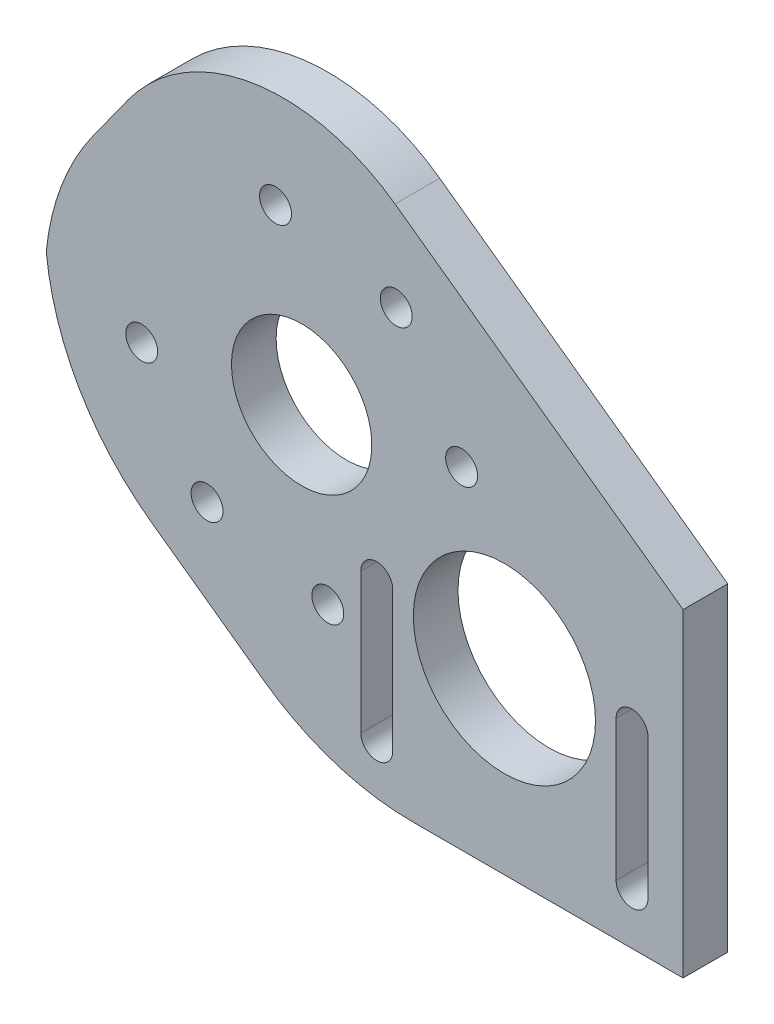
ISO-10303-21;
HEADER;
FILE_DESCRIPTION(('STEP AP214'),'2;1');
FILE_NAME('part.step','',(''),(''),'','','');
FILE_SCHEMA(('AUTOMOTIVE_DESIGN { 1 0 10303 214 1 1 1 1 }'));
ENDSEC;
DATA;
#1=APPLICATION_CONTEXT('core data for automotive mechanical design processes');
#2=APPLICATION_PROTOCOL_DEFINITION('international standard','automotive_design',2000,#1);
#3=PRODUCT_CONTEXT('',#1,'mechanical');
#4=PRODUCT('Part','Part','',(#3));
#5=PRODUCT_RELATED_PRODUCT_CATEGORY('part','',(#4));
#6=PRODUCT_DEFINITION_FORMATION('','',#4);
#7=PRODUCT_DEFINITION_CONTEXT('part definition',#1,'design');
#8=PRODUCT_DEFINITION('design','',#6,#7);
#9=PRODUCT_DEFINITION_SHAPE('','',#8);
#10=(LENGTH_UNIT() NAMED_UNIT(*) SI_UNIT(.MILLI.,.METRE.));
#11=(NAMED_UNIT(*) PLANE_ANGLE_UNIT() SI_UNIT($,.RADIAN.));
#12=(NAMED_UNIT(*) SI_UNIT($,.STERADIAN.) SOLID_ANGLE_UNIT());
#13=UNCERTAINTY_MEASURE_WITH_UNIT(LENGTH_MEASURE(1.E-05),#10,'distance_accuracy_value','');
#14=(GEOMETRIC_REPRESENTATION_CONTEXT(3) GLOBAL_UNCERTAINTY_ASSIGNED_CONTEXT((#13)) GLOBAL_UNIT_ASSIGNED_CONTEXT((#10,
#11,#12)) REPRESENTATION_CONTEXT('',''));
#15=CARTESIAN_POINT('',(0.,0.,0.));
#16=DIRECTION('',(0.,0.,1.));
#17=DIRECTION('',(1.,0.,0.));
#18=AXIS2_PLACEMENT_3D('',#15,#16,#17);
#19=CARTESIAN_POINT('',(0.,0.,7.));
#20=DIRECTION('',(0.,1.,0.));
#21=DIRECTION('',(0.,0.,1.));
#22=AXIS2_PLACEMENT_3D('',#19,#20,#21);
#23=PLANE('',#22);
#24=DIRECTION('',(1.,0.,0.));
#25=VECTOR('',#24,1.);
#26=CARTESIAN_POINT('',(0.,0.,7.));
#27=LINE('',#26,#25);
#28=CARTESIAN_POINT('',(57.6399419284707,0.,7.));
#29=VERTEX_POINT('',#28);
#30=CARTESIAN_POINT('',(100.,0.,7.));
#31=VERTEX_POINT('',#30);
#32=EDGE_CURVE('E190',#29,#31,#27,.T.);
#33=ORIENTED_EDGE('',*,*,#32,.F.);
#34=DIRECTION('',(0.,0.,1.));
#35=VECTOR('',#34,1.);
#36=CARTESIAN_POINT('',(57.6399419284707,0.,0.));
#37=LINE('',#36,#35);
#38=CARTESIAN_POINT('',(57.6399419284707,0.,0.));
#39=VERTEX_POINT('',#38);
#40=EDGE_CURVE('E227',#29,#39,#37,.F.);
#41=ORIENTED_EDGE('',*,*,#40,.T.);
#42=DIRECTION('',(1.,0.,0.));
#43=VECTOR('',#42,1.);
#44=CARTESIAN_POINT('',(0.,0.,0.));
#45=LINE('',#44,#43);
#46=CARTESIAN_POINT('',(100.,0.,0.));
#47=VERTEX_POINT('',#46);
#48=EDGE_CURVE('E186',#39,#47,#45,.T.);
#49=ORIENTED_EDGE('',*,*,#48,.T.);
#50=DIRECTION('',(0.,0.,-1.));
#51=VECTOR('',#50,1.);
#52=CARTESIAN_POINT('',(100.,0.,7.));
#53=LINE('',#52,#51);
#54=EDGE_CURVE('E191',#31,#47,#53,.T.);
#55=ORIENTED_EDGE('',*,*,#54,.F.);
#56=EDGE_LOOP('',(#33,#41,#49,#55));
#57=FACE_BOUND('',#56,.T.);
#58=ADVANCED_FACE('F44',(#57),#23,.F.);
#59=CARTESIAN_POINT('',(0.,0.,7.));
#60=DIRECTION('',(0.,0.,-1.));
#61=DIRECTION('',(-1.,0.,0.));
#62=AXIS2_PLACEMENT_3D('',#59,#60,#61);
#63=PLANE('',#62);
#64=CARTESIAN_POINT('',(72.,28.,7.));
#65=DIRECTION('',(0.,0.,1.));
#66=DIRECTION('',(1.,0.,0.));
#67=AXIS2_PLACEMENT_3D('',#64,#65,#66);
#68=CIRCLE('',#67,14.275);
#69=CARTESIAN_POINT('',(86.275,28.,7.));
#70=VERTEX_POINT('',#69);
#71=EDGE_CURVE('E195',#70,#70,#68,.T.);
#72=ORIENTED_EDGE('',*,*,#71,.F.);
#73=EDGE_LOOP('',(#72));
#74=FACE_BOUND('',#73,.T.);
#75=DIRECTION('',(0.,-1.,0.));
#76=VECTOR('',#75,1.);
#77=CARTESIAN_POINT('',(49.5,30.,7.));
#78=LINE('',#77,#76);
#79=CARTESIAN_POINT('',(49.5,30.,7.));
#80=VERTEX_POINT('',#79);
#81=CARTESIAN_POINT('',(49.5,8.,7.));
#82=VERTEX_POINT('',#81);
#83=EDGE_CURVE('E324',#80,#82,#78,.T.);
#84=ORIENTED_EDGE('',*,*,#83,.F.);
#85=CARTESIAN_POINT('',(52.,30.,7.));
#86=DIRECTION('',(0.,0.,1.));
#87=DIRECTION('',(1.,0.,0.));
#88=AXIS2_PLACEMENT_3D('',#85,#86,#87);
#89=CIRCLE('',#88,2.5);
#90=CARTESIAN_POINT('',(54.5,30.,7.));
#91=VERTEX_POINT('',#90);
#92=EDGE_CURVE('E328',#91,#80,#89,.T.);
#93=ORIENTED_EDGE('',*,*,#92,.F.);
#94=DIRECTION('',(0.,1.,0.));
#95=VECTOR('',#94,1.);
#96=CARTESIAN_POINT('',(54.5,30.,7.));
#97=LINE('',#96,#95);
#98=CARTESIAN_POINT('',(54.5,8.,7.));
#99=VERTEX_POINT('',#98);
#100=EDGE_CURVE('E317',#99,#91,#97,.T.);
#101=ORIENTED_EDGE('',*,*,#100,.F.);
#102=CARTESIAN_POINT('',(52.,8.,7.));
#103=DIRECTION('',(0.,0.,1.));
#104=DIRECTION('',(1.,0.,0.));
#105=AXIS2_PLACEMENT_3D('',#102,#103,#104);
#106=CIRCLE('',#105,2.5);
#107=EDGE_CURVE('E316',#82,#99,#106,.T.);
#108=ORIENTED_EDGE('',*,*,#107,.F.);
#109=EDGE_LOOP('',(#84,#93,#101,#108));
#110=FACE_BOUND('',#109,.T.);
#111=DIRECTION('',(0.,-1.,0.));
#112=VECTOR('',#111,1.);
#113=CARTESIAN_POINT('',(89.5,30.,7.));
#114=LINE('',#113,#112);
#115=CARTESIAN_POINT('',(89.5,30.,7.));
#116=VERTEX_POINT('',#115);
#117=CARTESIAN_POINT('',(89.5,8.,7.));
#118=VERTEX_POINT('',#117);
#119=EDGE_CURVE('E351',#116,#118,#114,.T.);
#120=ORIENTED_EDGE('',*,*,#119,.F.);
#121=CARTESIAN_POINT('',(92.,30.,7.));
#122=DIRECTION('',(0.,0.,1.));
#123=DIRECTION('',(1.,0.,0.));
#124=AXIS2_PLACEMENT_3D('',#121,#122,#123);
#125=CIRCLE('',#124,2.50000000000002);
#126=CARTESIAN_POINT('',(94.5,30.,7.));
#127=VERTEX_POINT('',#126);
#128=EDGE_CURVE('E314',#127,#116,#125,.T.);
#129=ORIENTED_EDGE('',*,*,#128,.F.);
#130=DIRECTION('',(0.,1.,0.));
#131=VECTOR('',#130,1.);
#132=CARTESIAN_POINT('',(94.5,30.,7.));
#133=LINE('',#132,#131);
#134=CARTESIAN_POINT('',(94.5,8.,7.));
#135=VERTEX_POINT('',#134);
#136=EDGE_CURVE('E350',#135,#127,#133,.T.);
#137=ORIENTED_EDGE('',*,*,#136,.F.);
#138=CARTESIAN_POINT('',(92.,8.,7.));
#139=DIRECTION('',(0.,0.,1.));
#140=DIRECTION('',(1.,0.,0.));
#141=AXIS2_PLACEMENT_3D('',#138,#139,#140);
#142=CIRCLE('',#141,2.5);
#143=EDGE_CURVE('E349',#118,#135,#142,.T.);
#144=ORIENTED_EDGE('',*,*,#143,.F.);
#145=EDGE_LOOP('',(#120,#129,#137,#144));
#146=FACE_BOUND('',#145,.T.);
#147=CARTESIAN_POINT('',(40.2255244130042,47.9156396124104,7.));
#148=DIRECTION('',(0.,0.,-1.));
#149=DIRECTION('',(-1.,0.,0.));
#150=AXIS2_PLACEMENT_3D('',#147,#148,#149);
#151=CIRCLE('',#150,11.);
#152=CARTESIAN_POINT('',(29.2255244130042,47.9156396124104,7.));
#153=VERTEX_POINT('',#152);
#154=EDGE_CURVE('E301',#153,#153,#151,.T.);
#155=ORIENTED_EDGE('',*,*,#154,.T.);
#156=EDGE_LOOP('',(#155));
#157=FACE_BOUND('',#156,.T.);
#158=CARTESIAN_POINT('',(65.2929630047839,52.0124093700795,7.));
#159=DIRECTION('',(0.,0.,-1.));
#160=DIRECTION('',(-1.,0.,0.));
#161=AXIS2_PLACEMENT_3D('',#158,#159,#160);
#162=CIRCLE('',#161,2.5);
#163=CARTESIAN_POINT('',(62.7929630047839,52.0124093700795,7.));
#164=VERTEX_POINT('',#163);
#165=EDGE_CURVE('E260',#164,#164,#162,.T.);
#166=ORIENTED_EDGE('',*,*,#165,.T.);
#167=EDGE_LOOP('',(#166));
#168=FACE_BOUND('',#167,.T.);
#169=CARTESIAN_POINT('',(55.0540265516212,68.537849104243,7.));
#170=DIRECTION('',(0.,0.,-1.));
#171=DIRECTION('',(-1.,0.,0.));
#172=AXIS2_PLACEMENT_3D('',#169,#170,#171);
#173=CIRCLE('',#172,2.5);
#174=CARTESIAN_POINT('',(52.5540265516212,68.537849104243,7.));
#175=VERTEX_POINT('',#174);
#176=EDGE_CURVE('E295',#175,#175,#173,.T.);
#177=ORIENTED_EDGE('',*,*,#176,.T.);
#178=EDGE_LOOP('',(#177));
#179=FACE_BOUND('',#178,.T.);
#180=CARTESIAN_POINT('',(44.3222941706733,22.8482010206306,7.));
#181=DIRECTION('',(0.,0.,-1.));
#182=DIRECTION('',(-1.,0.,0.));
#183=AXIS2_PLACEMENT_3D('',#180,#181,#182);
#184=CIRCLE('',#183,2.5);
#185=CARTESIAN_POINT('',(41.8222941706733,22.8482010206306,7.));
#186=VERTEX_POINT('',#185);
#187=EDGE_CURVE('E290',#186,#186,#184,.T.);
#188=ORIENTED_EDGE('',*,*,#187,.T.);
#189=EDGE_LOOP('',(#188));
#190=FACE_BOUND('',#189,.T.);
#191=CARTESIAN_POINT('',(25.3970222743872,27.2934301205777,7.));
#192=DIRECTION('',(0.,0.,-1.));
#193=DIRECTION('',(-1.,0.,0.));
#194=AXIS2_PLACEMENT_3D('',#191,#192,#193);
#195=CIRCLE('',#194,2.5);
#196=CARTESIAN_POINT('',(22.8970222743872,27.2934301205777,7.));
#197=VERTEX_POINT('',#196);
#198=EDGE_CURVE('E285',#197,#197,#195,.T.);
#199=ORIENTED_EDGE('',*,*,#198,.T.);
#200=EDGE_LOOP('',(#199));
#201=FACE_BOUND('',#200,.T.);
#202=CARTESIAN_POINT('',(36.128754655335,72.9830782041901,7.));
#203=DIRECTION('',(0.,0.,-1.));
#204=DIRECTION('',(-1.,0.,0.));
#205=AXIS2_PLACEMENT_3D('',#202,#203,#204);
#206=CIRCLE('',#205,2.5);
#207=CARTESIAN_POINT('',(33.628754655335,72.9830782041901,7.));
#208=VERTEX_POINT('',#207);
#209=EDGE_CURVE('E276',#208,#208,#206,.T.);
#210=ORIENTED_EDGE('',*,*,#209,.T.);
#211=EDGE_LOOP('',(#210));
#212=FACE_BOUND('',#211,.T.);
#213=CARTESIAN_POINT('',(15.1580858212245,43.8188698547412,7.));
#214=DIRECTION('',(0.,0.,-1.));
#215=DIRECTION('',(-1.,0.,0.));
#216=AXIS2_PLACEMENT_3D('',#213,#214,#215);
#217=CIRCLE('',#216,2.5);
#218=CARTESIAN_POINT('',(12.6580858212245,43.8188698547412,7.));
#219=VERTEX_POINT('',#218);
#220=EDGE_CURVE('E267',#219,#219,#217,.T.);
#221=ORIENTED_EDGE('',*,*,#220,.T.);
#222=EDGE_LOOP('',(#221));
#223=FACE_BOUND('',#222,.T.);
#224=DIRECTION('',(-0.811720156453846,0.584046562875379,0.));
#225=VECTOR('',#224,1.);
#226=CARTESIAN_POINT('',(15.2630151135655,21.2128583634596,7.));
#227=LINE('',#226,#225);
#228=CARTESIAN_POINT('',(34.2780794134555,7.53119374184617,7.));
#229=VERTEX_POINT('',#228);
#230=CARTESIAN_POINT('',(16.6381374849848,20.223434251991,7.));
#231=VERTEX_POINT('',#230);
#232=EDGE_CURVE('E243',#229,#231,#227,.T.);
#233=ORIENTED_EDGE('',*,*,#232,.F.);
#234=CARTESIAN_POINT('',(57.6399419284707,40.,7.00000000000001));
#235=DIRECTION('',(0.,0.,-1.));
#236=DIRECTION('',(-1.,0.,0.));
#237=AXIS2_PLACEMENT_3D('',#234,#235,#236);
#238=CIRCLE('',#237,40.);
#239=EDGE_CURVE('E223',#229,#29,#238,.F.);
#240=ORIENTED_EDGE('',*,*,#239,.T.);
#241=ORIENTED_EDGE('',*,*,#32,.T.);
#242=DIRECTION('',(0.,1.,0.));
#243=VECTOR('',#242,1.);
#244=CARTESIAN_POINT('',(100.,0.,7.));
#245=LINE('',#244,#243);
#246=CARTESIAN_POINT('',(100.,50.,7.00000000000001));
#247=VERTEX_POINT('',#246);
#248=EDGE_CURVE('E179',#31,#247,#245,.T.);
#249=ORIENTED_EDGE('',*,*,#248,.T.);
#250=DIRECTION('',(0.811720156453846,-0.584046562875379,0.));
#251=VECTOR('',#250,1.);
#252=CARTESIAN_POINT('',(57.8151571303311,80.3527173590261,7.));
#253=LINE('',#252,#251);
#254=CARTESIAN_POINT('',(54.860556543483,82.4786031137386,7.));
#255=VERTEX_POINT('',#254);
#256=EDGE_CURVE('E161',#255,#247,#253,.T.);
#257=ORIENTED_EDGE('',*,*,#256,.F.);
#258=CARTESIAN_POINT('',(37.3391596572216,58.1269984201233,7.00000000000001));
#259=DIRECTION('',(0.,0.,-1.));
#260=DIRECTION('',(-1.,0.,0.));
#261=AXIS2_PLACEMENT_3D('',#258,#259,#260);
#262=CIRCLE('',#261,30.);
#263=CARTESIAN_POINT('',(12.9875549636062,75.6483953063846,7.));
#264=VERTEX_POINT('',#263);
#265=EDGE_CURVE('E206',#255,#264,#262,.F.);
#266=ORIENTED_EDGE('',*,*,#265,.T.);
#267=DIRECTION('',(0.584046562875379,0.811720156453846,0.));
#268=VECTOR('',#267,1.);
#269=CARTESIAN_POINT('',(-27.3062052804635,19.6472826409738,7.));
#270=LINE('',#269,#268);
#271=CARTESIAN_POINT('',(7.53119374184616,68.0650300986677,7.));
#272=VERTEX_POINT('',#271);
#273=EDGE_CURVE('E172',#272,#264,#270,.T.);
#274=ORIENTED_EDGE('',*,*,#273,.F.);
#275=CARTESIAN_POINT('',(40.,44.7031675836526,7.00000000000001));
#276=DIRECTION('',(0.,0.,-1.));
#277=DIRECTION('',(-1.,0.,0.));
#278=AXIS2_PLACEMENT_3D('',#275,#276,#277);
#279=CIRCLE('',#278,40.);
#280=CARTESIAN_POINT('',(0.199953788421331,48.6977040468987,7.));
#281=VERTEX_POINT('',#280);
#282=EDGE_CURVE('E222',#272,#281,#279,.F.);
#283=ORIENTED_EDGE('',*,*,#282,.T.);
#284=CARTESIAN_POINT('',(40.,52.6922405101448,7.));
#285=DIRECTION('',(0.,0.,-1.));
#286=DIRECTION('',(-1.,0.,0.));
#287=AXIS2_PLACEMENT_3D('',#284,#285,#286);
#288=CIRCLE('',#287,40.);
#289=EDGE_CURVE('E225',#281,#231,#288,.F.);
#290=ORIENTED_EDGE('',*,*,#289,.T.);
#291=EDGE_LOOP('',(#233,#240,#241,#249,#257,#266,#274,#283,#290));
#292=FACE_BOUND('',#291,.T.);
#293=ADVANCED_FACE('F184',(#74,#110,#146,#157,#168,#179,#190,#201,#212,#223,#292),#63,.F.);
#294=CARTESIAN_POINT('',(0.,0.,0.));
#295=DIRECTION('',(0.,0.,-1.));
#296=DIRECTION('',(-1.,0.,0.));
#297=AXIS2_PLACEMENT_3D('',#294,#295,#296);
#298=PLANE('',#297);
#299=CARTESIAN_POINT('',(15.1580858212245,43.8188698547412,0.));
#300=DIRECTION('',(0.,0.,-1.));
#301=DIRECTION('',(-1.,0.,0.));
#302=AXIS2_PLACEMENT_3D('',#299,#300,#301);
#303=CIRCLE('',#302,2.5);
#304=CARTESIAN_POINT('',(12.6580858212245,43.8188698547412,0.));
#305=VERTEX_POINT('',#304);
#306=EDGE_CURVE('E268',#305,#305,#303,.T.);
#307=ORIENTED_EDGE('',*,*,#306,.F.);
#308=EDGE_LOOP('',(#307));
#309=FACE_BOUND('',#308,.T.);
#310=CARTESIAN_POINT('',(36.128754655335,72.9830782041901,0.));
#311=DIRECTION('',(0.,0.,-1.));
#312=DIRECTION('',(-1.,0.,0.));
#313=AXIS2_PLACEMENT_3D('',#310,#311,#312);
#314=CIRCLE('',#313,2.5);
#315=CARTESIAN_POINT('',(33.628754655335,72.9830782041901,0.));
#316=VERTEX_POINT('',#315);
#317=EDGE_CURVE('E271',#316,#316,#314,.T.);
#318=ORIENTED_EDGE('',*,*,#317,.F.);
#319=EDGE_LOOP('',(#318));
#320=FACE_BOUND('',#319,.T.);
#321=CARTESIAN_POINT('',(25.3970222743872,27.2934301205777,0.));
#322=DIRECTION('',(0.,0.,-1.));
#323=DIRECTION('',(-1.,0.,0.));
#324=AXIS2_PLACEMENT_3D('',#321,#322,#323);
#325=CIRCLE('',#324,2.5);
#326=CARTESIAN_POINT('',(22.8970222743872,27.2934301205777,0.));
#327=VERTEX_POINT('',#326);
#328=EDGE_CURVE('E278',#327,#327,#325,.T.);
#329=ORIENTED_EDGE('',*,*,#328,.F.);
#330=EDGE_LOOP('',(#329));
#331=FACE_BOUND('',#330,.T.);
#332=CARTESIAN_POINT('',(44.3222941706733,22.8482010206306,0.));
#333=DIRECTION('',(0.,0.,-1.));
#334=DIRECTION('',(-1.,0.,0.));
#335=AXIS2_PLACEMENT_3D('',#332,#333,#334);
#336=CIRCLE('',#335,2.5);
#337=CARTESIAN_POINT('',(41.8222941706733,22.8482010206306,0.));
#338=VERTEX_POINT('',#337);
#339=EDGE_CURVE('E284',#338,#338,#336,.T.);
#340=ORIENTED_EDGE('',*,*,#339,.F.);
#341=EDGE_LOOP('',(#340));
#342=FACE_BOUND('',#341,.T.);
#343=CARTESIAN_POINT('',(55.0540265516212,68.537849104243,0.));
#344=DIRECTION('',(0.,0.,-1.));
#345=DIRECTION('',(-1.,0.,0.));
#346=AXIS2_PLACEMENT_3D('',#343,#344,#345);
#347=CIRCLE('',#346,2.5);
#348=CARTESIAN_POINT('',(52.5540265516212,68.537849104243,0.));
#349=VERTEX_POINT('',#348);
#350=EDGE_CURVE('E293',#349,#349,#347,.T.);
#351=ORIENTED_EDGE('',*,*,#350,.F.);
#352=EDGE_LOOP('',(#351));
#353=FACE_BOUND('',#352,.T.);
#354=CARTESIAN_POINT('',(65.2929630047839,52.0124093700795,0.));
#355=DIRECTION('',(0.,0.,-1.));
#356=DIRECTION('',(-1.,0.,0.));
#357=AXIS2_PLACEMENT_3D('',#354,#355,#356);
#358=CIRCLE('',#357,2.5);
#359=CARTESIAN_POINT('',(62.7929630047839,52.0124093700795,0.));
#360=VERTEX_POINT('',#359);
#361=EDGE_CURVE('E261',#360,#360,#358,.T.);
#362=ORIENTED_EDGE('',*,*,#361,.F.);
#363=EDGE_LOOP('',(#362));
#364=FACE_BOUND('',#363,.T.);
#365=CARTESIAN_POINT('',(40.2255244130042,47.9156396124104,0.));
#366=DIRECTION('',(0.,0.,-1.));
#367=DIRECTION('',(-1.,0.,0.));
#368=AXIS2_PLACEMENT_3D('',#365,#366,#367);
#369=CIRCLE('',#368,11.);
#370=CARTESIAN_POINT('',(29.2255244130042,47.9156396124104,0.));
#371=VERTEX_POINT('',#370);
#372=EDGE_CURVE('E266',#371,#371,#369,.T.);
#373=ORIENTED_EDGE('',*,*,#372,.F.);
#374=EDGE_LOOP('',(#373));
#375=FACE_BOUND('',#374,.T.);
#376=CARTESIAN_POINT('',(92.,30.,0.));
#377=DIRECTION('',(0.,0.,1.));
#378=DIRECTION('',(1.,0.,0.));
#379=AXIS2_PLACEMENT_3D('',#376,#377,#378);
#380=CIRCLE('',#379,2.50000000000002);
#381=CARTESIAN_POINT('',(94.5,30.,0.));
#382=VERTEX_POINT('',#381);
#383=CARTESIAN_POINT('',(89.5,30.,0.));
#384=VERTEX_POINT('',#383);
#385=EDGE_CURVE('E352',#382,#384,#380,.T.);
#386=ORIENTED_EDGE('',*,*,#385,.T.);
#387=DIRECTION('',(0.,-1.,0.));
#388=VECTOR('',#387,1.);
#389=CARTESIAN_POINT('',(89.5,30.,0.));
#390=LINE('',#389,#388);
#391=CARTESIAN_POINT('',(89.5,8.,0.));
#392=VERTEX_POINT('',#391);
#393=EDGE_CURVE('E361',#384,#392,#390,.T.);
#394=ORIENTED_EDGE('',*,*,#393,.T.);
#395=CARTESIAN_POINT('',(92.,8.,0.));
#396=DIRECTION('',(0.,0.,1.));
#397=DIRECTION('',(1.,0.,0.));
#398=AXIS2_PLACEMENT_3D('',#395,#396,#397);
#399=CIRCLE('',#398,2.5);
#400=CARTESIAN_POINT('',(94.5,8.,0.));
#401=VERTEX_POINT('',#400);
#402=EDGE_CURVE('E359',#392,#401,#399,.T.);
#403=ORIENTED_EDGE('',*,*,#402,.T.);
#404=DIRECTION('',(0.,1.,0.));
#405=VECTOR('',#404,1.);
#406=CARTESIAN_POINT('',(94.5,30.,0.));
#407=LINE('',#406,#405);
#408=EDGE_CURVE('E341',#401,#382,#407,.T.);
#409=ORIENTED_EDGE('',*,*,#408,.T.);
#410=EDGE_LOOP('',(#386,#394,#403,#409));
#411=FACE_BOUND('',#410,.T.);
#412=CARTESIAN_POINT('',(52.,30.,0.));
#413=DIRECTION('',(0.,0.,1.));
#414=DIRECTION('',(1.,0.,0.));
#415=AXIS2_PLACEMENT_3D('',#412,#413,#414);
#416=CIRCLE('',#415,2.5);
#417=CARTESIAN_POINT('',(54.5,30.,0.));
#418=VERTEX_POINT('',#417);
#419=CARTESIAN_POINT('',(49.5,30.,0.));
#420=VERTEX_POINT('',#419);
#421=EDGE_CURVE('E318',#418,#420,#416,.T.);
#422=ORIENTED_EDGE('',*,*,#421,.T.);
#423=DIRECTION('',(0.,-1.,0.));
#424=VECTOR('',#423,1.);
#425=CARTESIAN_POINT('',(49.5,30.,0.));
#426=LINE('',#425,#424);
#427=CARTESIAN_POINT('',(49.5,8.,0.));
#428=VERTEX_POINT('',#427);
#429=EDGE_CURVE('E335',#420,#428,#426,.T.);
#430=ORIENTED_EDGE('',*,*,#429,.T.);
#431=CARTESIAN_POINT('',(52.,8.,0.));
#432=DIRECTION('',(0.,0.,1.));
#433=DIRECTION('',(1.,0.,0.));
#434=AXIS2_PLACEMENT_3D('',#431,#432,#433);
#435=CIRCLE('',#434,2.5);
#436=CARTESIAN_POINT('',(54.5,8.,0.));
#437=VERTEX_POINT('',#436);
#438=EDGE_CURVE('E329',#428,#437,#435,.T.);
#439=ORIENTED_EDGE('',*,*,#438,.T.);
#440=DIRECTION('',(0.,1.,0.));
#441=VECTOR('',#440,1.);
#442=CARTESIAN_POINT('',(54.5,30.,0.));
#443=LINE('',#442,#441);
#444=EDGE_CURVE('E308',#437,#418,#443,.T.);
#445=ORIENTED_EDGE('',*,*,#444,.T.);
#446=EDGE_LOOP('',(#422,#430,#439,#445));
#447=FACE_BOUND('',#446,.T.);
#448=CARTESIAN_POINT('',(72.,28.,0.));
#449=DIRECTION('',(0.,0.,1.));
#450=DIRECTION('',(1.,0.,0.));
#451=AXIS2_PLACEMENT_3D('',#448,#449,#450);
#452=CIRCLE('',#451,14.275);
#453=CARTESIAN_POINT('',(86.275,28.,0.));
#454=VERTEX_POINT('',#453);
#455=EDGE_CURVE('E196',#454,#454,#452,.T.);
#456=ORIENTED_EDGE('',*,*,#455,.T.);
#457=EDGE_LOOP('',(#456));
#458=FACE_BOUND('',#457,.T.);
#459=ORIENTED_EDGE('',*,*,#48,.F.);
#460=CARTESIAN_POINT('',(57.6399419284707,40.,0.));
#461=DIRECTION('',(0.,0.,-1.));
#462=DIRECTION('',(-1.,0.,0.));
#463=AXIS2_PLACEMENT_3D('',#460,#461,#462);
#464=CIRCLE('',#463,40.);
#465=CARTESIAN_POINT('',(34.2780794134555,7.53119374184617,0.));
#466=VERTEX_POINT('',#465);
#467=EDGE_CURVE('E53',#39,#466,#464,.T.);
#468=ORIENTED_EDGE('',*,*,#467,.T.);
#469=DIRECTION('',(-0.811720156453846,0.584046562875379,0.));
#470=VECTOR('',#469,1.);
#471=CARTESIAN_POINT('',(15.2630151135655,21.2128583634596,0.));
#472=LINE('',#471,#470);
#473=CARTESIAN_POINT('',(16.6381374849848,20.223434251991,0.));
#474=VERTEX_POINT('',#473);
#475=EDGE_CURVE('E203',#466,#474,#472,.T.);
#476=ORIENTED_EDGE('',*,*,#475,.T.);
#477=CARTESIAN_POINT('',(40.,52.6922405101448,0.));
#478=DIRECTION('',(0.,0.,-1.));
#479=DIRECTION('',(-1.,0.,0.));
#480=AXIS2_PLACEMENT_3D('',#477,#478,#479);
#481=CIRCLE('',#480,40.);
#482=CARTESIAN_POINT('',(0.199953788421331,48.6977040468987,0.));
#483=VERTEX_POINT('',#482);
#484=EDGE_CURVE('E61',#474,#483,#481,.T.);
#485=ORIENTED_EDGE('',*,*,#484,.T.);
#486=CARTESIAN_POINT('',(40.,44.7031675836526,0.));
#487=DIRECTION('',(0.,0.,-1.));
#488=DIRECTION('',(-1.,0.,0.));
#489=AXIS2_PLACEMENT_3D('',#486,#487,#488);
#490=CIRCLE('',#489,40.);
#491=CARTESIAN_POINT('',(7.53119374184616,68.0650300986677,0.));
#492=VERTEX_POINT('',#491);
#493=EDGE_CURVE('E65',#483,#492,#490,.T.);
#494=ORIENTED_EDGE('',*,*,#493,.T.);
#495=DIRECTION('',(0.584046562875379,0.811720156453846,0.));
#496=VECTOR('',#495,1.);
#497=CARTESIAN_POINT('',(-27.3062052804635,19.6472826409738,0.));
#498=LINE('',#497,#496);
#499=CARTESIAN_POINT('',(12.9875549636062,75.6483953063846,0.));
#500=VERTEX_POINT('',#499);
#501=EDGE_CURVE('E205',#492,#500,#498,.T.);
#502=ORIENTED_EDGE('',*,*,#501,.T.);
#503=CARTESIAN_POINT('',(37.3391596572216,58.1269984201233,0.));
#504=DIRECTION('',(0.,0.,-1.));
#505=DIRECTION('',(-1.,0.,0.));
#506=AXIS2_PLACEMENT_3D('',#503,#504,#505);
#507=CIRCLE('',#506,30.);
#508=CARTESIAN_POINT('',(54.860556543483,82.4786031137386,0.));
#509=VERTEX_POINT('',#508);
#510=EDGE_CURVE('E214',#500,#509,#507,.T.);
#511=ORIENTED_EDGE('',*,*,#510,.T.);
#512=DIRECTION('',(0.811720156453846,-0.584046562875379,0.));
#513=VECTOR('',#512,1.);
#514=CARTESIAN_POINT('',(57.8151571303311,80.3527173590261,0.));
#515=LINE('',#514,#513);
#516=CARTESIAN_POINT('',(100.,50.,0.));
#517=VERTEX_POINT('',#516);
#518=EDGE_CURVE('E202',#509,#517,#515,.T.);
#519=ORIENTED_EDGE('',*,*,#518,.T.);
#520=DIRECTION('',(0.,1.,0.));
#521=VECTOR('',#520,1.);
#522=CARTESIAN_POINT('',(100.,0.,0.));
#523=LINE('',#522,#521);
#524=EDGE_CURVE('E185',#47,#517,#523,.T.);
#525=ORIENTED_EDGE('',*,*,#524,.F.);
#526=EDGE_LOOP('',(#459,#468,#476,#485,#494,#502,#511,#519,#525));
#527=FACE_BOUND('',#526,.T.);
#528=ADVANCED_FACE('F234',(#309,#320,#331,#342,#353,#364,#375,#411,#447,#458,#527),#298,.T.);
#529=CARTESIAN_POINT('',(100.,0.,7.));
#530=DIRECTION('',(-1.,0.,0.));
#531=DIRECTION('',(0.,0.,1.));
#532=AXIS2_PLACEMENT_3D('',#529,#530,#531);
#533=PLANE('',#532);
#534=ORIENTED_EDGE('',*,*,#524,.T.);
#535=DIRECTION('',(0.,0.,1.));
#536=VECTOR('',#535,1.);
#537=CARTESIAN_POINT('',(100.,50.,-176.993114272844));
#538=LINE('',#537,#536);
#539=EDGE_CURVE('E170',#517,#247,#538,.T.);
#540=ORIENTED_EDGE('',*,*,#539,.T.);
#541=ORIENTED_EDGE('',*,*,#248,.F.);
#542=ORIENTED_EDGE('',*,*,#54,.T.);
#543=EDGE_LOOP('',(#534,#540,#541,#542));
#544=FACE_BOUND('',#543,.T.);
#545=ADVANCED_FACE('F178',(#544),#533,.F.);
#546=CARTESIAN_POINT('',(72.,28.,0.));
#547=DIRECTION('',(0.,0.,1.));
#548=DIRECTION('',(1.,0.,0.));
#549=AXIS2_PLACEMENT_3D('',#546,#547,#548);
#550=CYLINDRICAL_SURFACE('',#549,14.275);
#551=ORIENTED_EDGE('',*,*,#455,.F.);
#552=EDGE_LOOP('',(#551));
#553=FACE_BOUND('',#552,.T.);
#554=ORIENTED_EDGE('',*,*,#71,.T.);
#555=EDGE_LOOP('',(#554));
#556=FACE_BOUND('',#555,.T.);
#557=ADVANCED_FACE('F373',(#553,#556),#550,.F.);
#558=CARTESIAN_POINT('',(52.,30.,0.));
#559=DIRECTION('',(0.,0.,1.));
#560=DIRECTION('',(1.,0.,0.));
#561=AXIS2_PLACEMENT_3D('',#558,#559,#560);
#562=CYLINDRICAL_SURFACE('',#561,2.5);
#563=ORIENTED_EDGE('',*,*,#92,.T.);
#564=DIRECTION('',(0.,0.,1.));
#565=VECTOR('',#564,1.);
#566=CARTESIAN_POINT('',(49.5,30.,0.));
#567=LINE('',#566,#565);
#568=EDGE_CURVE('E304',#420,#80,#567,.T.);
#569=ORIENTED_EDGE('',*,*,#568,.F.);
#570=ORIENTED_EDGE('',*,*,#421,.F.);
#571=DIRECTION('',(0.,0.,1.));
#572=VECTOR('',#571,1.);
#573=CARTESIAN_POINT('',(54.5,30.,0.));
#574=LINE('',#573,#572);
#575=EDGE_CURVE('E312',#418,#91,#574,.T.);
#576=ORIENTED_EDGE('',*,*,#575,.T.);
#577=EDGE_LOOP('',(#563,#569,#570,#576));
#578=FACE_BOUND('',#577,.T.);
#579=ADVANCED_FACE('F426',(#578),#562,.F.);
#580=CARTESIAN_POINT('',(54.5,30.,0.));
#581=DIRECTION('',(1.,0.,0.));
#582=DIRECTION('',(0.,1.,0.));
#583=AXIS2_PLACEMENT_3D('',#580,#581,#582);
#584=PLANE('',#583);
#585=ORIENTED_EDGE('',*,*,#100,.T.);
#586=ORIENTED_EDGE('',*,*,#575,.F.);
#587=ORIENTED_EDGE('',*,*,#444,.F.);
#588=DIRECTION('',(0.,0.,1.));
#589=VECTOR('',#588,1.);
#590=CARTESIAN_POINT('',(54.5,8.,0.));
#591=LINE('',#590,#589);
#592=EDGE_CURVE('E311',#437,#99,#591,.T.);
#593=ORIENTED_EDGE('',*,*,#592,.T.);
#594=EDGE_LOOP('',(#585,#586,#587,#593));
#595=FACE_BOUND('',#594,.T.);
#596=ADVANCED_FACE('F436',(#595),#584,.F.);
#597=CARTESIAN_POINT('',(52.,8.,0.));
#598=DIRECTION('',(0.,0.,1.));
#599=DIRECTION('',(1.,0.,0.));
#600=AXIS2_PLACEMENT_3D('',#597,#598,#599);
#601=CYLINDRICAL_SURFACE('',#600,2.5);
#602=ORIENTED_EDGE('',*,*,#107,.T.);
#603=ORIENTED_EDGE('',*,*,#592,.F.);
#604=ORIENTED_EDGE('',*,*,#438,.F.);
#605=DIRECTION('',(0.,0.,1.));
#606=VECTOR('',#605,1.);
#607=CARTESIAN_POINT('',(49.5,8.,0.));
#608=LINE('',#607,#606);
#609=EDGE_CURVE('E307',#428,#82,#608,.T.);
#610=ORIENTED_EDGE('',*,*,#609,.T.);
#611=EDGE_LOOP('',(#602,#603,#604,#610));
#612=FACE_BOUND('',#611,.T.);
#613=ADVANCED_FACE('F433',(#612),#601,.F.);
#614=CARTESIAN_POINT('',(49.5,30.,0.));
#615=DIRECTION('',(-1.,0.,0.));
#616=DIRECTION('',(0.,0.,1.));
#617=AXIS2_PLACEMENT_3D('',#614,#615,#616);
#618=PLANE('',#617);
#619=ORIENTED_EDGE('',*,*,#83,.T.);
#620=ORIENTED_EDGE('',*,*,#609,.F.);
#621=ORIENTED_EDGE('',*,*,#429,.F.);
#622=ORIENTED_EDGE('',*,*,#568,.T.);
#623=EDGE_LOOP('',(#619,#620,#621,#622));
#624=FACE_BOUND('',#623,.T.);
#625=ADVANCED_FACE('F431',(#624),#618,.F.);
#626=CARTESIAN_POINT('',(92.,30.,0.));
#627=DIRECTION('',(0.,0.,1.));
#628=DIRECTION('',(1.,0.,0.));
#629=AXIS2_PLACEMENT_3D('',#626,#627,#628);
#630=CYLINDRICAL_SURFACE('',#629,2.50000000000002);
#631=ORIENTED_EDGE('',*,*,#128,.T.);
#632=DIRECTION('',(0.,0.,1.));
#633=VECTOR('',#632,1.);
#634=CARTESIAN_POINT('',(89.5,30.,0.));
#635=LINE('',#634,#633);
#636=EDGE_CURVE('E336',#384,#116,#635,.T.);
#637=ORIENTED_EDGE('',*,*,#636,.F.);
#638=ORIENTED_EDGE('',*,*,#385,.F.);
#639=DIRECTION('',(0.,0.,1.));
#640=VECTOR('',#639,1.);
#641=CARTESIAN_POINT('',(94.5,30.,0.));
#642=LINE('',#641,#640);
#643=EDGE_CURVE('E302',#382,#127,#642,.T.);
#644=ORIENTED_EDGE('',*,*,#643,.T.);
#645=EDGE_LOOP('',(#631,#637,#638,#644));
#646=FACE_BOUND('',#645,.T.);
#647=ADVANCED_FACE('F623',(#646),#630,.F.);
#648=CARTESIAN_POINT('',(94.5,30.,0.));
#649=DIRECTION('',(1.,0.,0.));
#650=DIRECTION('',(0.,1.,0.));
#651=AXIS2_PLACEMENT_3D('',#648,#649,#650);
#652=PLANE('',#651);
#653=ORIENTED_EDGE('',*,*,#136,.T.);
#654=ORIENTED_EDGE('',*,*,#643,.F.);
#655=ORIENTED_EDGE('',*,*,#408,.F.);
#656=DIRECTION('',(0.,0.,1.));
#657=VECTOR('',#656,1.);
#658=CARTESIAN_POINT('',(94.5,8.,0.));
#659=LINE('',#658,#657);
#660=EDGE_CURVE('E343',#401,#135,#659,.T.);
#661=ORIENTED_EDGE('',*,*,#660,.T.);
#662=EDGE_LOOP('',(#653,#654,#655,#661));
#663=FACE_BOUND('',#662,.T.);
#664=ADVANCED_FACE('F614',(#663),#652,.F.);
#665=CARTESIAN_POINT('',(92.,8.,0.));
#666=DIRECTION('',(0.,0.,1.));
#667=DIRECTION('',(1.,0.,0.));
#668=AXIS2_PLACEMENT_3D('',#665,#666,#667);
#669=CYLINDRICAL_SURFACE('',#668,2.5);
#670=ORIENTED_EDGE('',*,*,#143,.T.);
#671=ORIENTED_EDGE('',*,*,#660,.F.);
#672=ORIENTED_EDGE('',*,*,#402,.F.);
#673=DIRECTION('',(0.,0.,1.));
#674=VECTOR('',#673,1.);
#675=CARTESIAN_POINT('',(89.5,8.,0.));
#676=LINE('',#675,#674);
#677=EDGE_CURVE('E342',#392,#118,#676,.T.);
#678=ORIENTED_EDGE('',*,*,#677,.T.);
#679=EDGE_LOOP('',(#670,#671,#672,#678));
#680=FACE_BOUND('',#679,.T.);
#681=ADVANCED_FACE('F604',(#680),#669,.F.);
#682=CARTESIAN_POINT('',(89.5,30.,0.));
#683=DIRECTION('',(-1.,0.,0.));
#684=DIRECTION('',(0.,-1.,0.));
#685=AXIS2_PLACEMENT_3D('',#682,#683,#684);
#686=PLANE('',#685);
#687=ORIENTED_EDGE('',*,*,#119,.T.);
#688=ORIENTED_EDGE('',*,*,#677,.F.);
#689=ORIENTED_EDGE('',*,*,#393,.F.);
#690=ORIENTED_EDGE('',*,*,#636,.T.);
#691=EDGE_LOOP('',(#687,#688,#689,#690));
#692=FACE_BOUND('',#691,.T.);
#693=ADVANCED_FACE('F591',(#692),#686,.F.);
#694=CARTESIAN_POINT('',(40.2255244130042,47.9156396124104,10.));
#695=DIRECTION('',(0.,0.,-1.));
#696=DIRECTION('',(-1.,0.,0.));
#697=AXIS2_PLACEMENT_3D('',#694,#695,#696);
#698=CYLINDRICAL_SURFACE('',#697,11.);
#699=ORIENTED_EDGE('',*,*,#372,.T.);
#700=EDGE_LOOP('',(#699));
#701=FACE_BOUND('',#700,.T.);
#702=ORIENTED_EDGE('',*,*,#154,.F.);
#703=EDGE_LOOP('',(#702));
#704=FACE_BOUND('',#703,.T.);
#705=ADVANCED_FACE('F585',(#701,#704),#698,.F.);
#706=CARTESIAN_POINT('',(65.2929630047839,52.0124093700795,7.));
#707=DIRECTION('',(0.,0.,-1.));
#708=DIRECTION('',(-1.,0.,0.));
#709=AXIS2_PLACEMENT_3D('',#706,#707,#708);
#710=CYLINDRICAL_SURFACE('',#709,2.5);
#711=ORIENTED_EDGE('',*,*,#165,.F.);
#712=EDGE_LOOP('',(#711));
#713=FACE_BOUND('',#712,.T.);
#714=ORIENTED_EDGE('',*,*,#361,.T.);
#715=EDGE_LOOP('',(#714));
#716=FACE_BOUND('',#715,.T.);
#717=ADVANCED_FACE('F577',(#713,#716),#710,.F.);
#718=CARTESIAN_POINT('',(55.0540265516212,68.537849104243,7.));
#719=DIRECTION('',(0.,0.,-1.));
#720=DIRECTION('',(-1.,0.,0.));
#721=AXIS2_PLACEMENT_3D('',#718,#719,#720);
#722=CYLINDRICAL_SURFACE('',#721,2.5);
#723=ORIENTED_EDGE('',*,*,#176,.F.);
#724=EDGE_LOOP('',(#723));
#725=FACE_BOUND('',#724,.T.);
#726=ORIENTED_EDGE('',*,*,#350,.T.);
#727=EDGE_LOOP('',(#726));
#728=FACE_BOUND('',#727,.T.);
#729=ADVANCED_FACE('F570',(#725,#728),#722,.F.);
#730=CARTESIAN_POINT('',(44.3222941706733,22.8482010206306,7.));
#731=DIRECTION('',(0.,0.,-1.));
#732=DIRECTION('',(-1.,0.,0.));
#733=AXIS2_PLACEMENT_3D('',#730,#731,#732);
#734=CYLINDRICAL_SURFACE('',#733,2.5);
#735=ORIENTED_EDGE('',*,*,#187,.F.);
#736=EDGE_LOOP('',(#735));
#737=FACE_BOUND('',#736,.T.);
#738=ORIENTED_EDGE('',*,*,#339,.T.);
#739=EDGE_LOOP('',(#738));
#740=FACE_BOUND('',#739,.T.);
#741=ADVANCED_FACE('F556',(#737,#740),#734,.F.);
#742=CARTESIAN_POINT('',(25.3970222743872,27.2934301205777,7.));
#743=DIRECTION('',(0.,0.,-1.));
#744=DIRECTION('',(-1.,0.,0.));
#745=AXIS2_PLACEMENT_3D('',#742,#743,#744);
#746=CYLINDRICAL_SURFACE('',#745,2.5);
#747=ORIENTED_EDGE('',*,*,#198,.F.);
#748=EDGE_LOOP('',(#747));
#749=FACE_BOUND('',#748,.T.);
#750=ORIENTED_EDGE('',*,*,#328,.T.);
#751=EDGE_LOOP('',(#750));
#752=FACE_BOUND('',#751,.T.);
#753=ADVANCED_FACE('F546',(#749,#752),#746,.F.);
#754=CARTESIAN_POINT('',(36.128754655335,72.9830782041901,7.));
#755=DIRECTION('',(0.,0.,-1.));
#756=DIRECTION('',(-1.,0.,0.));
#757=AXIS2_PLACEMENT_3D('',#754,#755,#756);
#758=CYLINDRICAL_SURFACE('',#757,2.5);
#759=ORIENTED_EDGE('',*,*,#209,.F.);
#760=EDGE_LOOP('',(#759));
#761=FACE_BOUND('',#760,.T.);
#762=ORIENTED_EDGE('',*,*,#317,.T.);
#763=EDGE_LOOP('',(#762));
#764=FACE_BOUND('',#763,.T.);
#765=ADVANCED_FACE('F401',(#761,#764),#758,.F.);
#766=CARTESIAN_POINT('',(15.1580858212245,43.8188698547412,7.));
#767=DIRECTION('',(0.,0.,-1.));
#768=DIRECTION('',(-1.,0.,0.));
#769=AXIS2_PLACEMENT_3D('',#766,#767,#768);
#770=CYLINDRICAL_SURFACE('',#769,2.5);
#771=ORIENTED_EDGE('',*,*,#220,.F.);
#772=EDGE_LOOP('',(#771));
#773=FACE_BOUND('',#772,.T.);
#774=ORIENTED_EDGE('',*,*,#306,.T.);
#775=EDGE_LOOP('',(#774));
#776=FACE_BOUND('',#775,.T.);
#777=ADVANCED_FACE('F398',(#773,#776),#770,.F.);
#778=CARTESIAN_POINT('',(100.,50.,-176.993114272844));
#779=DIRECTION('',(0.584046562875379,0.811720156453846,0.));
#780=DIRECTION('',(-0.811720156453846,0.584046562875379,0.));
#781=AXIS2_PLACEMENT_3D('',#778,#779,#780);
#782=PLANE('',#781);
#783=ORIENTED_EDGE('',*,*,#518,.F.);
#784=DIRECTION('',(0.,0.,1.));
#785=VECTOR('',#784,1.);
#786=CARTESIAN_POINT('',(54.860556543483,82.4786031137386,-176.993114272844));
#787=LINE('',#786,#785);
#788=EDGE_CURVE('E167',#509,#255,#787,.T.);
#789=ORIENTED_EDGE('',*,*,#788,.T.);
#790=ORIENTED_EDGE('',*,*,#256,.T.);
#791=ORIENTED_EDGE('',*,*,#539,.F.);
#792=EDGE_LOOP('',(#783,#789,#790,#791));
#793=FACE_BOUND('',#792,.T.);
#794=ADVANCED_FACE('F168',(#793),#782,.T.);
#795=CARTESIAN_POINT('',(30.5089518498676,100.,-176.993114272844));
#796=DIRECTION('',(-0.811720156453846,0.584046562875379,0.));
#797=DIRECTION('',(-0.584046562875379,-0.811720156453846,0.));
#798=AXIS2_PLACEMENT_3D('',#795,#796,#797);
#799=PLANE('',#798);
#800=ORIENTED_EDGE('',*,*,#501,.F.);
#801=DIRECTION('',(0.,0.,1.));
#802=VECTOR('',#801,1.);
#803=CARTESIAN_POINT('',(7.53119374184615,68.0650300986677,-176.993114272844));
#804=LINE('',#803,#802);
#805=EDGE_CURVE('E11',#492,#272,#804,.T.);
#806=ORIENTED_EDGE('',*,*,#805,.T.);
#807=ORIENTED_EDGE('',*,*,#273,.T.);
#808=DIRECTION('',(0.,0.,1.));
#809=VECTOR('',#808,1.);
#810=CARTESIAN_POINT('',(12.9875549636062,75.6483953063846,-176.993114272844));
#811=LINE('',#810,#809);
#812=EDGE_CURVE('E208',#264,#500,#811,.F.);
#813=ORIENTED_EDGE('',*,*,#812,.T.);
#814=EDGE_LOOP('',(#800,#806,#807,#813));
#815=FACE_BOUND('',#814,.T.);
#816=ADVANCED_FACE('F478',(#815),#799,.T.);
#817=CARTESIAN_POINT('',(0.,32.1948592972996,-176.993114272844));
#818=DIRECTION('',(-0.584046562875379,-0.811720156453846,0.));
#819=DIRECTION('',(0.811720156453846,-0.584046562875379,0.));
#820=AXIS2_PLACEMENT_3D('',#817,#818,#819);
#821=PLANE('',#820);
#822=ORIENTED_EDGE('',*,*,#475,.F.);
#823=DIRECTION('',(0.,0.,1.));
#824=VECTOR('',#823,1.);
#825=CARTESIAN_POINT('',(34.2780794134555,7.53119374184617,7.00000000000001));
#826=LINE('',#825,#824);
#827=EDGE_CURVE('E216',#466,#229,#826,.T.);
#828=ORIENTED_EDGE('',*,*,#827,.T.);
#829=ORIENTED_EDGE('',*,*,#232,.T.);
#830=DIRECTION('',(0.,0.,1.));
#831=VECTOR('',#830,1.);
#832=CARTESIAN_POINT('',(16.6381374849848,20.223434251991,-176.993114272844));
#833=LINE('',#832,#831);
#834=EDGE_CURVE('E215',#231,#474,#833,.F.);
#835=ORIENTED_EDGE('',*,*,#834,.T.);
#836=EDGE_LOOP('',(#822,#828,#829,#835));
#837=FACE_BOUND('',#836,.T.);
#838=ADVANCED_FACE('F237',(#837),#821,.T.);
#839=CARTESIAN_POINT('',(37.3391596572216,58.1269984201233,-176.993114272844));
#840=DIRECTION('',(0.,0.,1.));
#841=DIRECTION('',(1.,0.,0.));
#842=AXIS2_PLACEMENT_3D('',#839,#840,#841);
#843=CYLINDRICAL_SURFACE('',#842,30.);
#844=ORIENTED_EDGE('',*,*,#510,.F.);
#845=ORIENTED_EDGE('',*,*,#812,.F.);
#846=ORIENTED_EDGE('',*,*,#265,.F.);
#847=ORIENTED_EDGE('',*,*,#788,.F.);
#848=EDGE_LOOP('',(#844,#845,#846,#847));
#849=FACE_BOUND('',#848,.T.);
#850=ADVANCED_FACE('F250',(#849),#843,.T.);
#851=CARTESIAN_POINT('',(57.6399419284707,40.,-176.993114272844));
#852=DIRECTION('',(0.,0.,-1.));
#853=DIRECTION('',(-1.,0.,0.));
#854=AXIS2_PLACEMENT_3D('',#851,#852,#853);
#855=CYLINDRICAL_SURFACE('',#854,40.);
#856=ORIENTED_EDGE('',*,*,#467,.F.);
#857=ORIENTED_EDGE('',*,*,#40,.F.);
#858=ORIENTED_EDGE('',*,*,#239,.F.);
#859=ORIENTED_EDGE('',*,*,#827,.F.);
#860=EDGE_LOOP('',(#856,#857,#858,#859));
#861=FACE_BOUND('',#860,.T.);
#862=ADVANCED_FACE('F245',(#861),#855,.T.);
#863=CARTESIAN_POINT('',(40.,44.7031675836526,-176.993114272844));
#864=DIRECTION('',(0.,0.,1.));
#865=DIRECTION('',(1.,0.,0.));
#866=AXIS2_PLACEMENT_3D('',#863,#864,#865);
#867=CYLINDRICAL_SURFACE('',#866,40.);
#868=ORIENTED_EDGE('',*,*,#805,.F.);
#869=ORIENTED_EDGE('',*,*,#493,.F.);
#870=DIRECTION('',(0.,0.,1.));
#871=VECTOR('',#870,1.);
#872=CARTESIAN_POINT('',(0.199953788421338,48.6977040468987,3.5));
#873=LINE('',#872,#871);
#874=EDGE_CURVE('E47',#281,#483,#873,.F.);
#875=ORIENTED_EDGE('',*,*,#874,.F.);
#876=ORIENTED_EDGE('',*,*,#282,.F.);
#877=EDGE_LOOP('',(#868,#869,#875,#876));
#878=FACE_BOUND('',#877,.T.);
#879=ADVANCED_FACE('F50',(#878),#867,.T.);
#880=CARTESIAN_POINT('',(40.,52.6922405101448,7.));
#881=DIRECTION('',(0.,0.,1.));
#882=DIRECTION('',(1.,0.,0.));
#883=AXIS2_PLACEMENT_3D('',#880,#881,#882);
#884=CYLINDRICAL_SURFACE('',#883,40.);
#885=ORIENTED_EDGE('',*,*,#484,.F.);
#886=ORIENTED_EDGE('',*,*,#834,.F.);
#887=ORIENTED_EDGE('',*,*,#289,.F.);
#888=ORIENTED_EDGE('',*,*,#874,.T.);
#889=EDGE_LOOP('',(#885,#886,#887,#888));
#890=FACE_BOUND('',#889,.T.);
#891=ADVANCED_FACE('F258',(#890),#884,.T.);
#892=CLOSED_SHELL('',(#58,#293,#528,#545,#557,#579,#596,#613,#625,#647,#664,#681,#693,#705,#717,
#729,#741,#753,#765,#777,#794,#816,#838,#850,#862,#879,#891));
#893=MANIFOLD_SOLID_BREP('B2',#892);
#894=ADVANCED_BREP_SHAPE_REPRESENTATION('',(#18,#893),#14);
#895=SHAPE_DEFINITION_REPRESENTATION(#9,#894);
ENDSEC;
END-ISO-10303-21;
